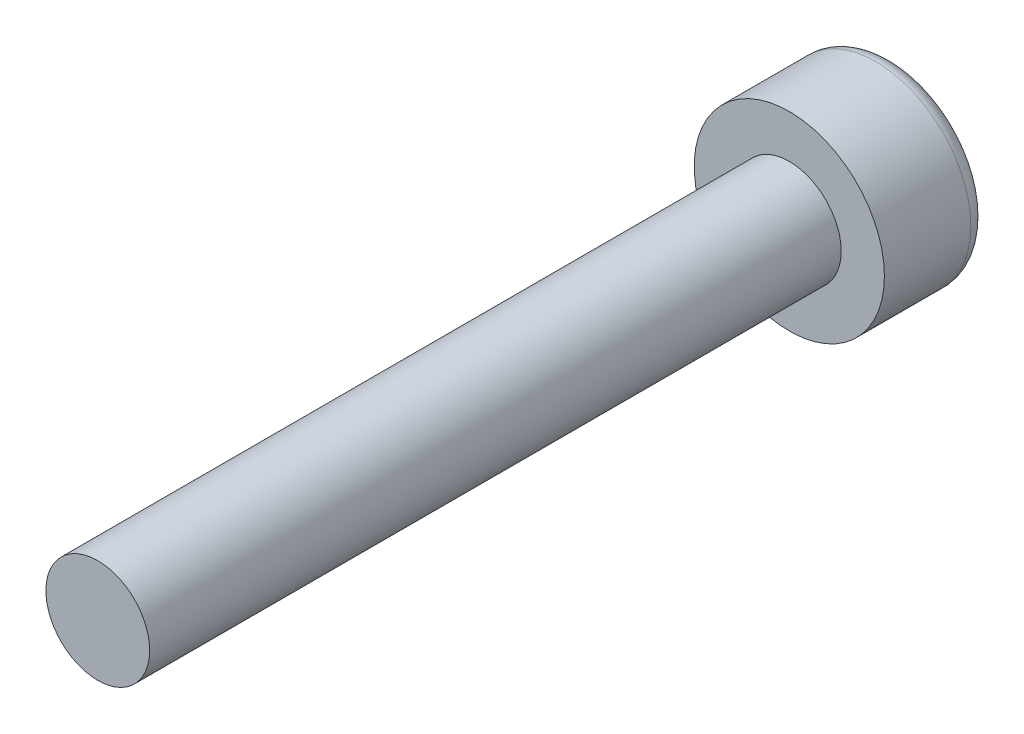
ISO-10303-21;
HEADER;
FILE_DESCRIPTION(('STEP AP214'),'2;1');
FILE_NAME('part.step','',(''),(''),'','','');
FILE_SCHEMA(('AUTOMOTIVE_DESIGN { 1 0 10303 214 1 1 1 1 }'));
ENDSEC;
DATA;
#1=APPLICATION_CONTEXT('core data for automotive mechanical design processes');
#2=APPLICATION_PROTOCOL_DEFINITION('international standard','automotive_design',2000,#1);
#3=PRODUCT_CONTEXT('',#1,'mechanical');
#4=PRODUCT('Part','Part','',(#3));
#5=PRODUCT_RELATED_PRODUCT_CATEGORY('part','',(#4));
#6=PRODUCT_DEFINITION_FORMATION('','',#4);
#7=PRODUCT_DEFINITION_CONTEXT('part definition',#1,'design');
#8=PRODUCT_DEFINITION('design','',#6,#7);
#9=PRODUCT_DEFINITION_SHAPE('','',#8);
#10=(LENGTH_UNIT() NAMED_UNIT(*) SI_UNIT(.MILLI.,.METRE.));
#11=(NAMED_UNIT(*) PLANE_ANGLE_UNIT() SI_UNIT($,.RADIAN.));
#12=(NAMED_UNIT(*) SI_UNIT($,.STERADIAN.) SOLID_ANGLE_UNIT());
#13=UNCERTAINTY_MEASURE_WITH_UNIT(LENGTH_MEASURE(1.E-05),#10,'distance_accuracy_value','');
#14=(GEOMETRIC_REPRESENTATION_CONTEXT(3) GLOBAL_UNCERTAINTY_ASSIGNED_CONTEXT((#13)) GLOBAL_UNIT_ASSIGNED_CONTEXT((#10,
#11,#12)) REPRESENTATION_CONTEXT('',''));
#15=CARTESIAN_POINT('',(0.,0.,0.));
#16=DIRECTION('',(0.,0.,1.));
#17=DIRECTION('',(1.,0.,0.));
#18=AXIS2_PLACEMENT_3D('',#15,#16,#17);
#19=CARTESIAN_POINT('',(0.,0.,3.));
#20=DIRECTION('',(0.,0.,-1.));
#21=DIRECTION('',(-1.,0.,0.));
#22=AXIS2_PLACEMENT_3D('',#19,#20,#21);
#23=CYLINDRICAL_SURFACE('',#22,2.75);
#24=CARTESIAN_POINT('',(0.,0.,0.5));
#25=DIRECTION('',(0.,0.,1.));
#26=DIRECTION('',(1.,0.,0.));
#27=AXIS2_PLACEMENT_3D('',#24,#25,#26);
#28=CIRCLE('',#27,2.75);
#29=CARTESIAN_POINT('',(2.75,0.,0.5));
#30=VERTEX_POINT('',#29);
#31=EDGE_CURVE('E39',#30,#30,#28,.T.);
#32=ORIENTED_EDGE('',*,*,#31,.T.);
#33=EDGE_LOOP('',(#32));
#34=FACE_BOUND('',#33,.T.);
#35=CARTESIAN_POINT('',(0.,0.,3.));
#36=DIRECTION('',(0.,0.,1.));
#37=DIRECTION('',(1.,0.,0.));
#38=AXIS2_PLACEMENT_3D('',#35,#36,#37);
#39=CIRCLE('',#38,2.75);
#40=CARTESIAN_POINT('',(2.75,0.,3.));
#41=VERTEX_POINT('',#40);
#42=EDGE_CURVE('E47',#41,#41,#39,.T.);
#43=ORIENTED_EDGE('',*,*,#42,.F.);
#44=EDGE_LOOP('',(#43));
#45=FACE_BOUND('',#44,.T.);
#46=ADVANCED_FACE('F32',(#34,#45),#23,.T.);
#47=CARTESIAN_POINT('',(0.,0.,3.));
#48=DIRECTION('',(0.,0.,1.));
#49=DIRECTION('',(1.,0.,0.));
#50=AXIS2_PLACEMENT_3D('',#47,#48,#49);
#51=PLANE('',#50);
#52=CARTESIAN_POINT('',(0.,0.,3.));
#53=DIRECTION('',(0.,0.,1.));
#54=DIRECTION('',(1.,0.,0.));
#55=AXIS2_PLACEMENT_3D('',#52,#53,#54);
#56=CIRCLE('',#55,1.5);
#57=CARTESIAN_POINT('',(1.5,0.,3.));
#58=VERTEX_POINT('',#57);
#59=EDGE_CURVE('E43',#58,#58,#56,.T.);
#60=ORIENTED_EDGE('',*,*,#59,.F.);
#61=EDGE_LOOP('',(#60));
#62=FACE_BOUND('',#61,.T.);
#63=ORIENTED_EDGE('',*,*,#42,.T.);
#64=EDGE_LOOP('',(#63));
#65=FACE_BOUND('',#64,.T.);
#66=ADVANCED_FACE('F65',(#62,#65),#51,.T.);
#67=CARTESIAN_POINT('',(0.,0.,0.));
#68=DIRECTION('',(0.,0.,1.));
#69=DIRECTION('',(1.,0.,0.));
#70=AXIS2_PLACEMENT_3D('',#67,#68,#69);
#71=PLANE('',#70);
#72=CARTESIAN_POINT('',(0.,0.,0.));
#73=DIRECTION('',(0.,0.,1.));
#74=DIRECTION('',(1.,0.,0.));
#75=AXIS2_PLACEMENT_3D('',#72,#73,#74);
#76=CIRCLE('',#75,2.25);
#77=CARTESIAN_POINT('',(2.25,0.,0.));
#78=VERTEX_POINT('',#77);
#79=EDGE_CURVE('E10',#78,#78,#76,.F.);
#80=ORIENTED_EDGE('',*,*,#79,.T.);
#81=EDGE_LOOP('',(#80));
#82=FACE_BOUND('',#81,.T.);
#83=ADVANCED_FACE('F61',(#82),#71,.F.);
#84=CARTESIAN_POINT('',(0.,0.,23.));
#85=DIRECTION('',(0.,0.,-1.));
#86=DIRECTION('',(-1.,0.,0.));
#87=AXIS2_PLACEMENT_3D('',#84,#85,#86);
#88=CYLINDRICAL_SURFACE('',#87,1.5);
#89=CARTESIAN_POINT('',(0.,0.,23.));
#90=DIRECTION('',(0.,0.,1.));
#91=DIRECTION('',(1.,0.,0.));
#92=AXIS2_PLACEMENT_3D('',#89,#90,#91);
#93=CIRCLE('',#92,1.5);
#94=CARTESIAN_POINT('',(1.5,0.,23.));
#95=VERTEX_POINT('',#94);
#96=EDGE_CURVE('E51',#95,#95,#93,.T.);
#97=ORIENTED_EDGE('',*,*,#96,.F.);
#98=EDGE_LOOP('',(#97));
#99=FACE_BOUND('',#98,.T.);
#100=ORIENTED_EDGE('',*,*,#59,.T.);
#101=EDGE_LOOP('',(#100));
#102=FACE_BOUND('',#101,.T.);
#103=ADVANCED_FACE('F58',(#99,#102),#88,.T.);
#104=CARTESIAN_POINT('',(0.,0.,23.));
#105=DIRECTION('',(0.,0.,1.));
#106=DIRECTION('',(1.,0.,0.));
#107=AXIS2_PLACEMENT_3D('',#104,#105,#106);
#108=PLANE('',#107);
#109=ORIENTED_EDGE('',*,*,#96,.T.);
#110=EDGE_LOOP('',(#109));
#111=FACE_BOUND('',#110,.T.);
#112=ADVANCED_FACE('F56',(#111),#108,.T.);
#113=CARTESIAN_POINT('',(0.,0.,0.5));
#114=DIRECTION('',(0.,0.,1.));
#115=DIRECTION('',(1.,0.,0.));
#116=AXIS2_PLACEMENT_3D('',#113,#114,#115);
#117=TOROIDAL_SURFACE('',#116,2.25,0.5);
#118=ORIENTED_EDGE('',*,*,#79,.F.);
#119=EDGE_LOOP('',(#118));
#120=FACE_BOUND('',#119,.T.);
#121=ORIENTED_EDGE('',*,*,#31,.F.);
#122=EDGE_LOOP('',(#121));
#123=FACE_BOUND('',#122,.T.);
#124=ADVANCED_FACE('F34',(#120,#123),#117,.T.);
#125=CLOSED_SHELL('',(#46,#66,#83,#103,#112,#124));
#126=MANIFOLD_SOLID_BREP('B2',#125);
#127=ADVANCED_BREP_SHAPE_REPRESENTATION('',(#18,#126),#14);
#128=SHAPE_DEFINITION_REPRESENTATION(#9,#127);
ENDSEC;
END-ISO-10303-21;
